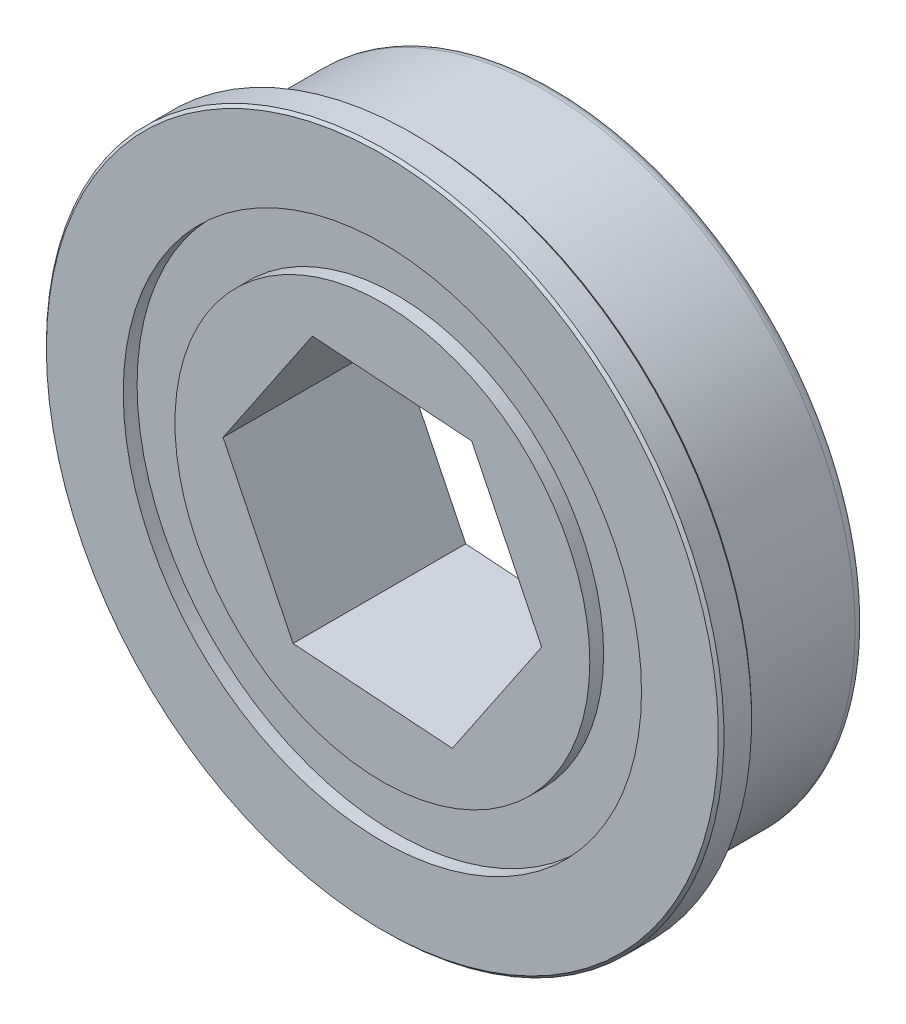
ISO-10303-21;
HEADER;
FILE_DESCRIPTION(('STEP AP214'),'2;1');
FILE_NAME('part.step','',(''),(''),'','','');
FILE_SCHEMA(('AUTOMOTIVE_DESIGN { 1 0 10303 214 1 1 1 1 }'));
ENDSEC;
DATA;
#1=APPLICATION_CONTEXT('core data for automotive mechanical design processes');
#2=APPLICATION_PROTOCOL_DEFINITION('international standard','automotive_design',2000,#1);
#3=PRODUCT_CONTEXT('',#1,'mechanical');
#4=PRODUCT('Part','Part','',(#3));
#5=PRODUCT_RELATED_PRODUCT_CATEGORY('part','',(#4));
#6=PRODUCT_DEFINITION_FORMATION('','',#4);
#7=PRODUCT_DEFINITION_CONTEXT('part definition',#1,'design');
#8=PRODUCT_DEFINITION('design','',#6,#7);
#9=PRODUCT_DEFINITION_SHAPE('','',#8);
#10=(LENGTH_UNIT() NAMED_UNIT(*) SI_UNIT(.MILLI.,.METRE.));
#11=(NAMED_UNIT(*) PLANE_ANGLE_UNIT() SI_UNIT($,.RADIAN.));
#12=(NAMED_UNIT(*) SI_UNIT($,.STERADIAN.) SOLID_ANGLE_UNIT());
#13=UNCERTAINTY_MEASURE_WITH_UNIT(LENGTH_MEASURE(1.E-05),#10,'distance_accuracy_value','');
#14=(GEOMETRIC_REPRESENTATION_CONTEXT(3) GLOBAL_UNCERTAINTY_ASSIGNED_CONTEXT((#13)) GLOBAL_UNIT_ASSIGNED_CONTEXT((#10,
#11,#12)) REPRESENTATION_CONTEXT('',''));
#15=CARTESIAN_POINT('',(0.,0.,0.));
#16=DIRECTION('',(0.,0.,1.));
#17=DIRECTION('',(1.,0.,0.));
#18=AXIS2_PLACEMENT_3D('',#15,#16,#17);
#19=CARTESIAN_POINT('',(0.,0.,-0.000999999999999265));
#20=DIRECTION('',(0.,0.,1.));
#21=DIRECTION('',(1.,0.,0.));
#22=AXIS2_PLACEMENT_3D('',#19,#20,#21);
#23=CYLINDRICAL_SURFACE('',#22,11.8991111578808);
#24=CARTESIAN_POINT('',(0.,0.,0.635));
#25=DIRECTION('',(0.,0.,-1.));
#26=DIRECTION('',(-1.,0.,0.));
#27=AXIS2_PLACEMENT_3D('',#24,#25,#26);
#28=CIRCLE('',#27,11.8991111578808);
#29=CARTESIAN_POINT('',(-11.8991111578808,0.,0.635));
#30=VERTEX_POINT('',#29);
#31=EDGE_CURVE('E144',#30,#30,#28,.T.);
#32=ORIENTED_EDGE('',*,*,#31,.F.);
#33=EDGE_LOOP('',(#32));
#34=FACE_BOUND('',#33,.T.);
#35=CARTESIAN_POINT('',(0.,0.,0.));
#36=DIRECTION('',(0.,0.,-1.));
#37=DIRECTION('',(-1.,0.,0.));
#38=AXIS2_PLACEMENT_3D('',#35,#36,#37);
#39=CIRCLE('',#38,11.8991111578808);
#40=CARTESIAN_POINT('',(-11.8991111578808,0.,0.));
#41=VERTEX_POINT('',#40);
#42=EDGE_CURVE('E148',#41,#41,#39,.F.);
#43=ORIENTED_EDGE('',*,*,#42,.F.);
#44=EDGE_LOOP('',(#43));
#45=FACE_BOUND('',#44,.T.);
#46=ADVANCED_FACE('F40',(#34,#45),#23,.F.);
#47=CARTESIAN_POINT('',(0.,0.,7.80034));
#48=DIRECTION('',(0.,0.,-1.));
#49=DIRECTION('',(-1.,0.,0.));
#50=AXIS2_PLACEMENT_3D('',#47,#48,#49);
#51=CONICAL_SURFACE('',#50,15.5575,0.785398163397442);
#52=CARTESIAN_POINT('',(0.,0.,7.92734));
#53=DIRECTION('',(0.,0.,-1.));
#54=DIRECTION('',(-1.,0.,0.));
#55=AXIS2_PLACEMENT_3D('',#52,#53,#54);
#56=CIRCLE('',#55,15.4305);
#57=CARTESIAN_POINT('',(-15.4305,0.,7.92734));
#58=VERTEX_POINT('',#57);
#59=EDGE_CURVE('E179',#58,#58,#56,.T.);
#60=ORIENTED_EDGE('',*,*,#59,.T.);
#61=EDGE_LOOP('',(#60));
#62=FACE_BOUND('',#61,.T.);
#63=CARTESIAN_POINT('',(0.,0.,7.80034));
#64=DIRECTION('',(0.,0.,-1.));
#65=DIRECTION('',(-1.,0.,0.));
#66=AXIS2_PLACEMENT_3D('',#63,#64,#65);
#67=CIRCLE('',#66,15.5575);
#68=CARTESIAN_POINT('',(-15.5575,0.,7.80034));
#69=VERTEX_POINT('',#68);
#70=EDGE_CURVE('E160',#69,#69,#67,.T.);
#71=ORIENTED_EDGE('',*,*,#70,.F.);
#72=EDGE_LOOP('',(#71));
#73=FACE_BOUND('',#72,.T.);
#74=ADVANCED_FACE('F212',(#62,#73),#51,.T.);
#75=CARTESIAN_POINT('',(15.4305,0.,7.92734));
#76=DIRECTION('',(0.,0.,1.));
#77=DIRECTION('',(1.,0.,0.));
#78=AXIS2_PLACEMENT_3D('',#75,#76,#77);
#79=PLANE('',#78);
#80=CARTESIAN_POINT('',(0.,0.,7.92734));
#81=DIRECTION('',(0.,0.,1.));
#82=DIRECTION('',(1.,0.,0.));
#83=AXIS2_PLACEMENT_3D('',#80,#81,#82);
#84=CIRCLE('',#83,11.8991111578808);
#85=CARTESIAN_POINT('',(11.8991111578808,0.,7.92734));
#86=VERTEX_POINT('',#85);
#87=EDGE_CURVE('E156',#86,#86,#84,.T.);
#88=ORIENTED_EDGE('',*,*,#87,.F.);
#89=EDGE_LOOP('',(#88));
#90=FACE_BOUND('',#89,.T.);
#91=ORIENTED_EDGE('',*,*,#59,.F.);
#92=EDGE_LOOP('',(#91));
#93=FACE_BOUND('',#92,.T.);
#94=ADVANCED_FACE('F217',(#90,#93),#79,.T.);
#95=CARTESIAN_POINT('',(0.,0.,0.));
#96=DIRECTION('',(0.,0.,-1.));
#97=DIRECTION('',(-1.,0.,0.));
#98=AXIS2_PLACEMENT_3D('',#95,#96,#97);
#99=PLANE('',#98);
#100=ORIENTED_EDGE('',*,*,#42,.T.);
#101=EDGE_LOOP('',(#100));
#102=FACE_BOUND('',#101,.T.);
#103=CARTESIAN_POINT('',(0.,0.,0.));
#104=DIRECTION('',(0.,0.,-1.));
#105=DIRECTION('',(-1.,0.,0.));
#106=AXIS2_PLACEMENT_3D('',#103,#104,#105);
#107=CIRCLE('',#106,13.7795);
#108=CARTESIAN_POINT('',(-13.7795,0.,0.));
#109=VERTEX_POINT('',#108);
#110=EDGE_CURVE('E49',#109,#109,#107,.T.);
#111=ORIENTED_EDGE('',*,*,#110,.T.);
#112=EDGE_LOOP('',(#111));
#113=FACE_BOUND('',#112,.T.);
#114=ADVANCED_FACE('F195',(#102,#113),#99,.T.);
#115=CARTESIAN_POINT('',(0.,0.,7.92734));
#116=DIRECTION('',(0.,0.,-1.));
#117=DIRECTION('',(-1.,0.,0.));
#118=AXIS2_PLACEMENT_3D('',#115,#116,#117);
#119=CYLINDRICAL_SURFACE('',#118,14.2875);
#120=CARTESIAN_POINT('',(0.,0.,0.508));
#121=DIRECTION('',(0.,0.,-1.));
#122=DIRECTION('',(-1.,0.,0.));
#123=AXIS2_PLACEMENT_3D('',#120,#121,#122);
#124=CIRCLE('',#123,14.2875);
#125=CARTESIAN_POINT('',(-14.2875,0.,0.508));
#126=VERTEX_POINT('',#125);
#127=EDGE_CURVE('E12',#126,#126,#124,.F.);
#128=ORIENTED_EDGE('',*,*,#127,.T.);
#129=EDGE_LOOP('',(#128));
#130=FACE_BOUND('',#129,.T.);
#131=CARTESIAN_POINT('',(0.,0.,5.89534));
#132=DIRECTION('',(0.,0.,-1.));
#133=DIRECTION('',(-1.,0.,0.));
#134=AXIS2_PLACEMENT_3D('',#131,#132,#133);
#135=CIRCLE('',#134,14.2875);
#136=CARTESIAN_POINT('',(-14.2875,0.,5.89534));
#137=VERTEX_POINT('',#136);
#138=EDGE_CURVE('E175',#137,#137,#135,.T.);
#139=ORIENTED_EDGE('',*,*,#138,.T.);
#140=EDGE_LOOP('',(#139));
#141=FACE_BOUND('',#140,.T.);
#142=ADVANCED_FACE('F240',(#130,#141),#119,.T.);
#143=CARTESIAN_POINT('',(14.2875,0.,5.89534));
#144=DIRECTION('',(0.,0.,1.));
#145=DIRECTION('',(1.,0.,0.));
#146=AXIS2_PLACEMENT_3D('',#143,#144,#145);
#147=PLANE('',#146);
#148=CARTESIAN_POINT('',(0.,0.,5.89534));
#149=DIRECTION('',(0.,0.,-1.));
#150=DIRECTION('',(-1.,0.,0.));
#151=AXIS2_PLACEMENT_3D('',#148,#149,#150);
#152=CIRCLE('',#151,13.97);
#153=CARTESIAN_POINT('',(-13.97,0.,5.89534));
#154=VERTEX_POINT('',#153);
#155=EDGE_CURVE('E171',#154,#154,#152,.T.);
#156=ORIENTED_EDGE('',*,*,#155,.T.);
#157=EDGE_LOOP('',(#156));
#158=FACE_BOUND('',#157,.T.);
#159=ORIENTED_EDGE('',*,*,#138,.F.);
#160=EDGE_LOOP('',(#159));
#161=FACE_BOUND('',#160,.T.);
#162=ADVANCED_FACE('F236',(#158,#161),#147,.T.);
#163=CARTESIAN_POINT('',(0.,0.,7.92734));
#164=DIRECTION('',(0.,0.,-1.));
#165=DIRECTION('',(-1.,0.,0.));
#166=AXIS2_PLACEMENT_3D('',#163,#164,#165);
#167=CYLINDRICAL_SURFACE('',#166,13.97);
#168=CARTESIAN_POINT('',(0.,0.,6.40333999999999));
#169=DIRECTION('',(0.,0.,-1.));
#170=DIRECTION('',(-1.,0.,0.));
#171=AXIS2_PLACEMENT_3D('',#168,#169,#170);
#172=CIRCLE('',#171,13.97);
#173=CARTESIAN_POINT('',(-13.97,0.,6.40333999999999));
#174=VERTEX_POINT('',#173);
#175=EDGE_CURVE('E167',#174,#174,#172,.T.);
#176=ORIENTED_EDGE('',*,*,#175,.T.);
#177=EDGE_LOOP('',(#176));
#178=FACE_BOUND('',#177,.T.);
#179=ORIENTED_EDGE('',*,*,#155,.F.);
#180=EDGE_LOOP('',(#179));
#181=FACE_BOUND('',#180,.T.);
#182=ADVANCED_FACE('F232',(#178,#181),#167,.T.);
#183=CARTESIAN_POINT('',(13.97,0.,6.40334));
#184=DIRECTION('',(0.,0.,-1.));
#185=DIRECTION('',(-1.,0.,0.));
#186=AXIS2_PLACEMENT_3D('',#183,#184,#185);
#187=PLANE('',#186);
#188=CARTESIAN_POINT('',(0.,0.,6.40334));
#189=DIRECTION('',(0.,0.,-1.));
#190=DIRECTION('',(-1.,0.,0.));
#191=AXIS2_PLACEMENT_3D('',#188,#189,#190);
#192=CIRCLE('',#191,15.4305);
#193=CARTESIAN_POINT('',(-15.4305,0.,6.40334));
#194=VERTEX_POINT('',#193);
#195=EDGE_CURVE('E183',#194,#194,#192,.T.);
#196=ORIENTED_EDGE('',*,*,#195,.T.);
#197=EDGE_LOOP('',(#196));
#198=FACE_BOUND('',#197,.T.);
#199=ORIENTED_EDGE('',*,*,#175,.F.);
#200=EDGE_LOOP('',(#199));
#201=FACE_BOUND('',#200,.T.);
#202=ADVANCED_FACE('F228',(#198,#201),#187,.T.);
#203=CARTESIAN_POINT('',(0.,0.,7.92734));
#204=DIRECTION('',(0.,0.,-1.));
#205=DIRECTION('',(-1.,0.,0.));
#206=AXIS2_PLACEMENT_3D('',#203,#204,#205);
#207=CYLINDRICAL_SURFACE('',#206,15.5575);
#208=CARTESIAN_POINT('',(0.,0.,6.53034000000001));
#209=DIRECTION('',(0.,0.,-1.));
#210=DIRECTION('',(-1.,0.,0.));
#211=AXIS2_PLACEMENT_3D('',#208,#209,#210);
#212=CIRCLE('',#211,15.5575);
#213=CARTESIAN_POINT('',(-15.5575,0.,6.53034000000001));
#214=VERTEX_POINT('',#213);
#215=EDGE_CURVE('E187',#214,#214,#212,.F.);
#216=ORIENTED_EDGE('',*,*,#215,.T.);
#217=EDGE_LOOP('',(#216));
#218=FACE_BOUND('',#217,.T.);
#219=ORIENTED_EDGE('',*,*,#70,.T.);
#220=EDGE_LOOP('',(#219));
#221=FACE_BOUND('',#220,.T.);
#222=ADVANCED_FACE('F208',(#218,#221),#207,.T.);
#223=CARTESIAN_POINT('',(0.,0.,6.40334));
#224=DIRECTION('',(0.,0.,1.));
#225=DIRECTION('',(1.,0.,0.));
#226=AXIS2_PLACEMENT_3D('',#223,#224,#225);
#227=CONICAL_SURFACE('',#226,15.4305,0.785398163397407);
#228=ORIENTED_EDGE('',*,*,#215,.F.);
#229=EDGE_LOOP('',(#228));
#230=FACE_BOUND('',#229,.T.);
#231=ORIENTED_EDGE('',*,*,#195,.F.);
#232=EDGE_LOOP('',(#231));
#233=FACE_BOUND('',#232,.T.);
#234=ADVANCED_FACE('F199',(#230,#233),#227,.T.);
#235=CARTESIAN_POINT('',(0.,0.,0.508));
#236=DIRECTION('',(0.,0.,-1.));
#237=DIRECTION('',(-1.,0.,0.));
#238=AXIS2_PLACEMENT_3D('',#235,#236,#237);
#239=TOROIDAL_SURFACE('',#238,13.7795,0.508);
#240=ORIENTED_EDGE('',*,*,#127,.F.);
#241=EDGE_LOOP('',(#240));
#242=FACE_BOUND('',#241,.T.);
#243=ORIENTED_EDGE('',*,*,#110,.F.);
#244=EDGE_LOOP('',(#243));
#245=FACE_BOUND('',#244,.T.);
#246=ADVANCED_FACE('F42',(#242,#245),#239,.T.);
#247=CARTESIAN_POINT('',(0.,0.,7.29234));
#248=DIRECTION('',(0.,0.,1.));
#249=DIRECTION('',(1.,0.,0.));
#250=AXIS2_PLACEMENT_3D('',#247,#248,#249);
#251=CIRCLE('',#250,11.8991111578808);
#252=CARTESIAN_POINT('',(11.8991111578808,0.,7.29234));
#253=VERTEX_POINT('',#252);
#254=EDGE_CURVE('E143',#253,#253,#251,.F.);
#255=ORIENTED_EDGE('',*,*,#254,.T.);
#256=EDGE_LOOP('',(#255));
#257=FACE_BOUND('',#256,.T.);
#258=ORIENTED_EDGE('',*,*,#87,.T.);
#259=EDGE_LOOP('',(#258));
#260=FACE_BOUND('',#259,.T.);
#261=ADVANCED_FACE('F198',(#257,#260),#23,.F.);
#262=CARTESIAN_POINT('',(0.,0.,0.635));
#263=DIRECTION('',(0.,0.,-1.));
#264=DIRECTION('',(-1.,0.,0.));
#265=AXIS2_PLACEMENT_3D('',#262,#263,#264);
#266=PLANE('',#265);
#267=CARTESIAN_POINT('',(0.,0.,0.635));
#268=DIRECTION('',(0.,0.,-1.));
#269=DIRECTION('',(-1.,0.,0.));
#270=AXIS2_PLACEMENT_3D('',#267,#268,#269);
#271=CIRCLE('',#270,9.525);
#272=CARTESIAN_POINT('',(-9.525,0.,0.635));
#273=VERTEX_POINT('',#272);
#274=EDGE_CURVE('E149',#273,#273,#271,.T.);
#275=ORIENTED_EDGE('',*,*,#274,.F.);
#276=EDGE_LOOP('',(#275));
#277=FACE_BOUND('',#276,.T.);
#278=ORIENTED_EDGE('',*,*,#31,.T.);
#279=EDGE_LOOP('',(#278));
#280=FACE_BOUND('',#279,.T.);
#281=ADVANCED_FACE('F205',(#277,#280),#266,.T.);
#282=CARTESIAN_POINT('',(15.4305,0.,7.29234));
#283=DIRECTION('',(0.,0.,1.));
#284=DIRECTION('',(1.,0.,0.));
#285=AXIS2_PLACEMENT_3D('',#282,#283,#284);
#286=PLANE('',#285);
#287=ORIENTED_EDGE('',*,*,#254,.F.);
#288=EDGE_LOOP('',(#287));
#289=FACE_BOUND('',#288,.T.);
#290=CARTESIAN_POINT('',(0.,0.,7.29234));
#291=DIRECTION('',(0.,0.,1.));
#292=DIRECTION('',(1.,0.,0.));
#293=AXIS2_PLACEMENT_3D('',#290,#291,#292);
#294=CIRCLE('',#293,9.525);
#295=CARTESIAN_POINT('',(9.525,0.,7.29234));
#296=VERTEX_POINT('',#295);
#297=EDGE_CURVE('E139',#296,#296,#294,.T.);
#298=ORIENTED_EDGE('',*,*,#297,.F.);
#299=EDGE_LOOP('',(#298));
#300=FACE_BOUND('',#299,.T.);
#301=ADVANCED_FACE('F224',(#289,#300),#286,.T.);
#302=CARTESIAN_POINT('',(0.,0.,34.8681083632075));
#303=DIRECTION('',(0.,0.,-1.));
#304=DIRECTION('',(-1.,0.,0.));
#305=AXIS2_PLACEMENT_3D('',#302,#303,#304);
#306=CYLINDRICAL_SURFACE('',#305,9.525);
#307=ORIENTED_EDGE('',*,*,#274,.T.);
#308=EDGE_LOOP('',(#307));
#309=FACE_BOUND('',#308,.T.);
#310=CARTESIAN_POINT('',(0.,0.,0.));
#311=DIRECTION('',(0.,0.,-1.));
#312=DIRECTION('',(-1.,0.,0.));
#313=AXIS2_PLACEMENT_3D('',#310,#311,#312);
#314=CIRCLE('',#313,9.525);
#315=CARTESIAN_POINT('',(-9.525,0.,0.));
#316=VERTEX_POINT('',#315);
#317=EDGE_CURVE('E434',#316,#316,#314,.T.);
#318=ORIENTED_EDGE('',*,*,#317,.F.);
#319=EDGE_LOOP('',(#318));
#320=FACE_BOUND('',#319,.T.);
#321=ADVANCED_FACE('F313',(#309,#320),#306,.T.);
#322=ORIENTED_EDGE('',*,*,#297,.T.);
#323=EDGE_LOOP('',(#322));
#324=FACE_BOUND('',#323,.T.);
#325=CARTESIAN_POINT('',(0.,0.,7.92734));
#326=DIRECTION('',(0.,0.,1.));
#327=DIRECTION('',(1.,0.,0.));
#328=AXIS2_PLACEMENT_3D('',#325,#326,#327);
#329=CIRCLE('',#328,9.525);
#330=CARTESIAN_POINT('',(9.525,0.,7.92734));
#331=VERTEX_POINT('',#330);
#332=EDGE_CURVE('E129',#331,#331,#329,.F.);
#333=ORIENTED_EDGE('',*,*,#332,.T.);
#334=EDGE_LOOP('',(#333));
#335=FACE_BOUND('',#334,.T.);
#336=ADVANCED_FACE('F325',(#324,#335),#306,.T.);
#337=CARTESIAN_POINT('',(7.31433054001112,-0.513714010705348,34.8681083632075));
#338=DIRECTION('',(0.828866647753209,-0.559446226408184,0.));
#339=DIRECTION('',(0.559446226408184,0.828866647753209,0.));
#340=AXIS2_PLACEMENT_3D('',#337,#338,#339);
#341=PLANE('',#340);
#342=DIRECTION('',(-0.559446226408184,-0.828866647753209,0.));
#343=VECTOR('',#342,1.);
#344=CARTESIAN_POINT('',(7.31433054001112,-0.513714010705348,7.92734));
#345=LINE('',#344,#343);
#346=CARTESIAN_POINT('',(7.31433054001112,-0.513714010705348,7.92734));
#347=VERTEX_POINT('',#346);
#348=CARTESIAN_POINT('',(3.21227588645474,-6.59125306467865,7.92734));
#349=VERTEX_POINT('',#348);
#350=EDGE_CURVE('E122',#347,#349,#345,.T.);
#351=ORIENTED_EDGE('',*,*,#350,.F.);
#352=DIRECTION('',(0.,0.,-1.));
#353=VECTOR('',#352,1.);
#354=CARTESIAN_POINT('',(7.31433054001112,-0.513714010705348,34.8681083632075));
#355=LINE('',#354,#353);
#356=CARTESIAN_POINT('',(7.31433054001112,-0.513714010705348,0.));
#357=VERTEX_POINT('',#356);
#358=EDGE_CURVE('E126',#347,#357,#355,.T.);
#359=ORIENTED_EDGE('',*,*,#358,.T.);
#360=DIRECTION('',(-0.559446226408184,-0.828866647753209,0.));
#361=VECTOR('',#360,1.);
#362=CARTESIAN_POINT('',(7.31433054001112,-0.513714010705348,0.));
#363=LINE('',#362,#361);
#364=CARTESIAN_POINT('',(3.21227588645474,-6.59125306467865,0.));
#365=VERTEX_POINT('',#364);
#366=EDGE_CURVE('E128',#357,#365,#363,.T.);
#367=ORIENTED_EDGE('',*,*,#366,.T.);
#368=DIRECTION('',(0.,0.,-1.));
#369=VECTOR('',#368,1.);
#370=CARTESIAN_POINT('',(3.21227588645474,-6.59125306467865,34.8681083632075));
#371=LINE('',#370,#369);
#372=EDGE_CURVE('E65',#349,#365,#371,.T.);
#373=ORIENTED_EDGE('',*,*,#372,.F.);
#374=EDGE_LOOP('',(#351,#359,#367,#373));
#375=FACE_BOUND('',#374,.T.);
#376=ADVANCED_FACE('F333',(#375),#341,.F.);
#377=CARTESIAN_POINT('',(4.10205465355639,6.0775390539733,34.8681083632075));
#378=DIRECTION('',(0.898927967997433,0.438096460099835,0.));
#379=DIRECTION('',(-0.438096460099835,0.898927967997433,0.));
#380=AXIS2_PLACEMENT_3D('',#377,#378,#379);
#381=PLANE('',#380);
#382=DIRECTION('',(0.438096460099835,-0.898927967997433,0.));
#383=VECTOR('',#382,1.);
#384=CARTESIAN_POINT('',(4.10205465355639,6.0775390539733,7.92734));
#385=LINE('',#384,#383);
#386=CARTESIAN_POINT('',(4.10205465355639,6.0775390539733,7.92734));
#387=VERTEX_POINT('',#386);
#388=EDGE_CURVE('E436',#387,#347,#385,.T.);
#389=ORIENTED_EDGE('',*,*,#388,.F.);
#390=DIRECTION('',(0.,0.,-1.));
#391=VECTOR('',#390,1.);
#392=CARTESIAN_POINT('',(4.10205465355639,6.0775390539733,34.8681083632075));
#393=LINE('',#392,#391);
#394=CARTESIAN_POINT('',(4.10205465355639,6.0775390539733,0.));
#395=VERTEX_POINT('',#394);
#396=EDGE_CURVE('E130',#387,#395,#393,.T.);
#397=ORIENTED_EDGE('',*,*,#396,.T.);
#398=DIRECTION('',(0.438096460099835,-0.898927967997433,0.));
#399=VECTOR('',#398,1.);
#400=CARTESIAN_POINT('',(4.10205465355639,6.0775390539733,0.));
#401=LINE('',#400,#399);
#402=EDGE_CURVE('E133',#395,#357,#401,.T.);
#403=ORIENTED_EDGE('',*,*,#402,.T.);
#404=ORIENTED_EDGE('',*,*,#358,.F.);
#405=EDGE_LOOP('',(#389,#397,#403,#404));
#406=FACE_BOUND('',#405,.T.);
#407=ADVANCED_FACE('F340',(#406),#381,.F.);
#408=CARTESIAN_POINT('',(-3.21227588645473,6.59125306467865,34.8681083632075));
#409=DIRECTION('',(0.0700613202442238,0.997542686508019,0.));
#410=DIRECTION('',(-0.997542686508019,0.0700613202442238,0.));
#411=AXIS2_PLACEMENT_3D('',#408,#409,#410);
#412=PLANE('',#411);
#413=DIRECTION('',(0.997542686508019,-0.0700613202442238,0.));
#414=VECTOR('',#413,1.);
#415=CARTESIAN_POINT('',(-3.21227588645473,6.59125306467865,7.92734));
#416=LINE('',#415,#414);
#417=CARTESIAN_POINT('',(-3.21227588645473,6.59125306467865,7.92734));
#418=VERTEX_POINT('',#417);
#419=EDGE_CURVE('E102',#418,#387,#416,.T.);
#420=ORIENTED_EDGE('',*,*,#419,.F.);
#421=DIRECTION('',(0.,0.,-1.));
#422=VECTOR('',#421,1.);
#423=CARTESIAN_POINT('',(-3.21227588645473,6.59125306467865,34.8681083632075));
#424=LINE('',#423,#422);
#425=CARTESIAN_POINT('',(-3.21227588645473,6.59125306467865,0.));
#426=VERTEX_POINT('',#425);
#427=EDGE_CURVE('E97',#418,#426,#424,.T.);
#428=ORIENTED_EDGE('',*,*,#427,.T.);
#429=DIRECTION('',(0.997542686508019,-0.0700613202442238,0.));
#430=VECTOR('',#429,1.);
#431=CARTESIAN_POINT('',(-3.21227588645473,6.59125306467865,0.));
#432=LINE('',#431,#430);
#433=EDGE_CURVE('E113',#426,#395,#432,.T.);
#434=ORIENTED_EDGE('',*,*,#433,.T.);
#435=ORIENTED_EDGE('',*,*,#396,.F.);
#436=EDGE_LOOP('',(#420,#428,#434,#435));
#437=FACE_BOUND('',#436,.T.);
#438=ADVANCED_FACE('F348',(#437),#412,.F.);
#439=CARTESIAN_POINT('',(-7.31433054001111,0.513714010705348,34.8681083632075));
#440=DIRECTION('',(-0.828866647753209,0.559446226408184,0.));
#441=DIRECTION('',(-0.559446226408184,-0.828866647753209,0.));
#442=AXIS2_PLACEMENT_3D('',#439,#440,#441);
#443=PLANE('',#442);
#444=DIRECTION('',(0.559446226408184,0.828866647753209,0.));
#445=VECTOR('',#444,1.);
#446=CARTESIAN_POINT('',(-7.31433054001111,0.513714010705348,7.92734));
#447=LINE('',#446,#445);
#448=CARTESIAN_POINT('',(-7.31433054001111,0.513714010705348,7.92734));
#449=VERTEX_POINT('',#448);
#450=EDGE_CURVE('E95',#449,#418,#447,.T.);
#451=ORIENTED_EDGE('',*,*,#450,.F.);
#452=DIRECTION('',(0.,0.,-1.));
#453=VECTOR('',#452,1.);
#454=CARTESIAN_POINT('',(-7.31433054001111,0.513714010705348,34.8681083632075));
#455=LINE('',#454,#453);
#456=CARTESIAN_POINT('',(-7.31433054001111,0.513714010705348,0.));
#457=VERTEX_POINT('',#456);
#458=EDGE_CURVE('E90',#449,#457,#455,.T.);
#459=ORIENTED_EDGE('',*,*,#458,.T.);
#460=DIRECTION('',(0.559446226408184,0.828866647753209,0.));
#461=VECTOR('',#460,1.);
#462=CARTESIAN_POINT('',(-7.31433054001111,0.513714010705348,0.));
#463=LINE('',#462,#461);
#464=EDGE_CURVE('E112',#457,#426,#463,.T.);
#465=ORIENTED_EDGE('',*,*,#464,.T.);
#466=ORIENTED_EDGE('',*,*,#427,.F.);
#467=EDGE_LOOP('',(#451,#459,#465,#466));
#468=FACE_BOUND('',#467,.T.);
#469=ADVANCED_FACE('F96',(#468),#443,.F.);
#470=CARTESIAN_POINT('',(-4.10205465355638,-6.0775390539733,34.8681083632075));
#471=DIRECTION('',(-0.898927967997433,-0.438096460099835,0.));
#472=DIRECTION('',(0.438096460099835,-0.898927967997433,0.));
#473=AXIS2_PLACEMENT_3D('',#470,#471,#472);
#474=PLANE('',#473);
#475=DIRECTION('',(-0.438096460099835,0.898927967997433,0.));
#476=VECTOR('',#475,1.);
#477=CARTESIAN_POINT('',(-4.10205465355638,-6.0775390539733,7.92734));
#478=LINE('',#477,#476);
#479=CARTESIAN_POINT('',(-4.10205465355638,-6.0775390539733,7.92734));
#480=VERTEX_POINT('',#479);
#481=EDGE_CURVE('E103',#480,#449,#478,.T.);
#482=ORIENTED_EDGE('',*,*,#481,.F.);
#483=DIRECTION('',(0.,0.,-1.));
#484=VECTOR('',#483,1.);
#485=CARTESIAN_POINT('',(-4.10205465355638,-6.0775390539733,34.8681083632075));
#486=LINE('',#485,#484);
#487=CARTESIAN_POINT('',(-4.10205465355638,-6.0775390539733,0.));
#488=VERTEX_POINT('',#487);
#489=EDGE_CURVE('E59',#480,#488,#486,.T.);
#490=ORIENTED_EDGE('',*,*,#489,.T.);
#491=DIRECTION('',(-0.438096460099835,0.898927967997433,0.));
#492=VECTOR('',#491,1.);
#493=CARTESIAN_POINT('',(-4.10205465355638,-6.0775390539733,0.));
#494=LINE('',#493,#492);
#495=EDGE_CURVE('E109',#488,#457,#494,.T.);
#496=ORIENTED_EDGE('',*,*,#495,.T.);
#497=ORIENTED_EDGE('',*,*,#458,.F.);
#498=EDGE_LOOP('',(#482,#490,#496,#497));
#499=FACE_BOUND('',#498,.T.);
#500=ADVANCED_FACE('F106',(#499),#474,.F.);
#501=CARTESIAN_POINT('',(3.21227588645474,-6.59125306467865,34.8681083632075));
#502=DIRECTION('',(-0.0700613202442235,-0.997542686508019,0.));
#503=DIRECTION('',(0.997542686508019,-0.0700613202442235,0.));
#504=AXIS2_PLACEMENT_3D('',#501,#502,#503);
#505=PLANE('',#504);
#506=DIRECTION('',(-0.997542686508019,0.0700613202442235,0.));
#507=VECTOR('',#506,1.);
#508=CARTESIAN_POINT('',(3.21227588645474,-6.59125306467865,7.92734));
#509=LINE('',#508,#507);
#510=EDGE_CURVE('E118',#349,#480,#509,.T.);
#511=ORIENTED_EDGE('',*,*,#510,.F.);
#512=ORIENTED_EDGE('',*,*,#372,.T.);
#513=DIRECTION('',(-0.997542686508019,0.0700613202442235,0.));
#514=VECTOR('',#513,1.);
#515=CARTESIAN_POINT('',(3.21227588645474,-6.59125306467865,0.));
#516=LINE('',#515,#514);
#517=EDGE_CURVE('E138',#365,#488,#516,.T.);
#518=ORIENTED_EDGE('',*,*,#517,.T.);
#519=ORIENTED_EDGE('',*,*,#489,.F.);
#520=EDGE_LOOP('',(#511,#512,#518,#519));
#521=FACE_BOUND('',#520,.T.);
#522=ADVANCED_FACE('F369',(#521),#505,.F.);
#523=CARTESIAN_POINT('',(0.,0.,0.));
#524=DIRECTION('',(0.,0.,-1.));
#525=DIRECTION('',(-1.,0.,0.));
#526=AXIS2_PLACEMENT_3D('',#523,#524,#525);
#527=PLANE('',#526);
#528=ORIENTED_EDGE('',*,*,#366,.F.);
#529=ORIENTED_EDGE('',*,*,#402,.F.);
#530=ORIENTED_EDGE('',*,*,#433,.F.);
#531=ORIENTED_EDGE('',*,*,#464,.F.);
#532=ORIENTED_EDGE('',*,*,#495,.F.);
#533=ORIENTED_EDGE('',*,*,#517,.F.);
#534=EDGE_LOOP('',(#528,#529,#530,#531,#532,#533));
#535=FACE_BOUND('',#534,.T.);
#536=ORIENTED_EDGE('',*,*,#317,.T.);
#537=EDGE_LOOP('',(#536));
#538=FACE_BOUND('',#537,.T.);
#539=ADVANCED_FACE('F376',(#535,#538),#527,.T.);
#540=CARTESIAN_POINT('',(15.4305,0.,7.92734));
#541=DIRECTION('',(0.,0.,1.));
#542=DIRECTION('',(1.,0.,0.));
#543=AXIS2_PLACEMENT_3D('',#540,#541,#542);
#544=PLANE('',#543);
#545=ORIENTED_EDGE('',*,*,#332,.F.);
#546=EDGE_LOOP('',(#545));
#547=FACE_BOUND('',#546,.T.);
#548=ORIENTED_EDGE('',*,*,#388,.T.);
#549=ORIENTED_EDGE('',*,*,#350,.T.);
#550=ORIENTED_EDGE('',*,*,#510,.T.);
#551=ORIENTED_EDGE('',*,*,#481,.T.);
#552=ORIENTED_EDGE('',*,*,#450,.T.);
#553=ORIENTED_EDGE('',*,*,#419,.T.);
#554=EDGE_LOOP('',(#548,#549,#550,#551,#552,#553));
#555=FACE_BOUND('',#554,.T.);
#556=ADVANCED_FACE('F116',(#547,#555),#544,.T.);
#557=CLOSED_SHELL('',(#46,#74,#94,#114,#142,#162,#182,#202,#222,#234,#246,#261,#281,#301,#321,
#336,#376,#407,#438,#469,#500,#522,#539,#556));
#558=MANIFOLD_SOLID_BREP('B2',#557);
#559=ADVANCED_BREP_SHAPE_REPRESENTATION('',(#18,#558),#14);
#560=SHAPE_DEFINITION_REPRESENTATION(#9,#559);
ENDSEC;
END-ISO-10303-21;
